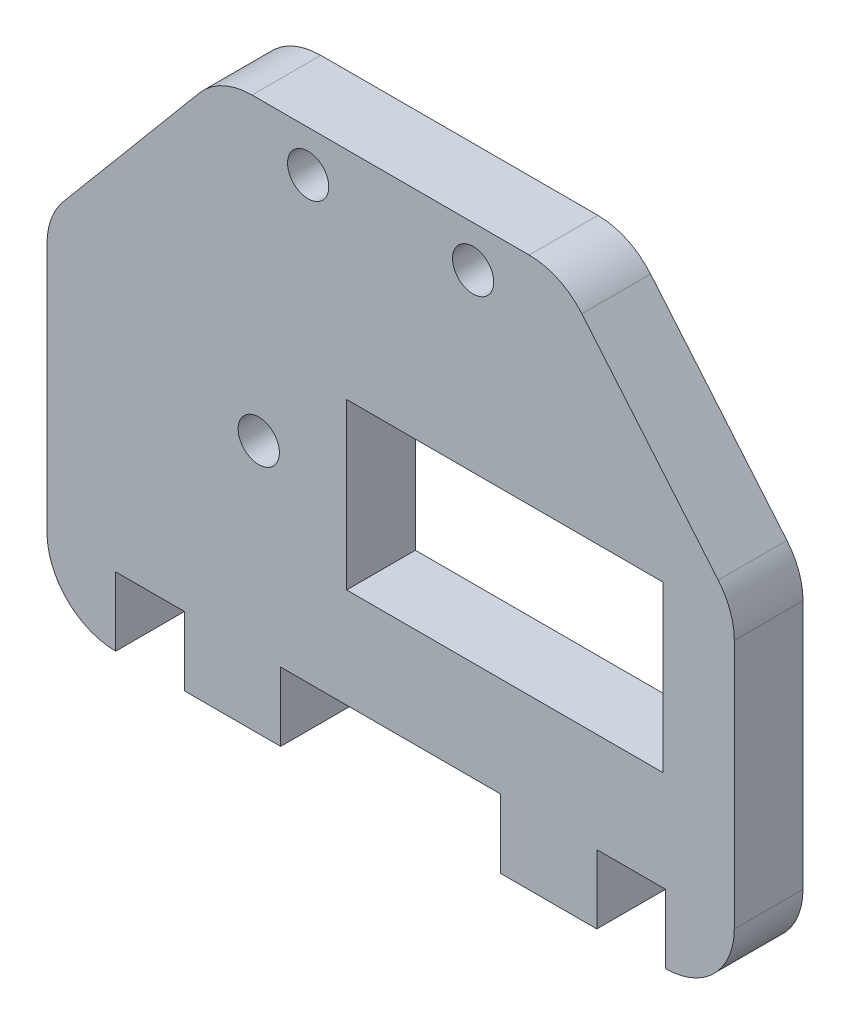
ISO-10303-21;
HEADER;
FILE_DESCRIPTION(('STEP AP214'),'2;1');
FILE_NAME('part.step','',(''),(''),'','','');
FILE_SCHEMA(('AUTOMOTIVE_DESIGN { 1 0 10303 214 1 1 1 1 }'));
ENDSEC;
DATA;
#1=APPLICATION_CONTEXT('core data for automotive mechanical design processes');
#2=APPLICATION_PROTOCOL_DEFINITION('international standard','automotive_design',2000,#1);
#3=PRODUCT_CONTEXT('',#1,'mechanical');
#4=PRODUCT('Part','Part','',(#3));
#5=PRODUCT_RELATED_PRODUCT_CATEGORY('part','',(#4));
#6=PRODUCT_DEFINITION_FORMATION('','',#4);
#7=PRODUCT_DEFINITION_CONTEXT('part definition',#1,'design');
#8=PRODUCT_DEFINITION('design','',#6,#7);
#9=PRODUCT_DEFINITION_SHAPE('','',#8);
#10=(LENGTH_UNIT() NAMED_UNIT(*) SI_UNIT(.MILLI.,.METRE.));
#11=(NAMED_UNIT(*) PLANE_ANGLE_UNIT() SI_UNIT($,.RADIAN.));
#12=(NAMED_UNIT(*) SI_UNIT($,.STERADIAN.) SOLID_ANGLE_UNIT());
#13=UNCERTAINTY_MEASURE_WITH_UNIT(LENGTH_MEASURE(1.E-05),#10,'distance_accuracy_value','');
#14=(GEOMETRIC_REPRESENTATION_CONTEXT(3) GLOBAL_UNCERTAINTY_ASSIGNED_CONTEXT((#13)) GLOBAL_UNIT_ASSIGNED_CONTEXT((#10,
#11,#12)) REPRESENTATION_CONTEXT('',''));
#15=CARTESIAN_POINT('',(0.,0.,0.));
#16=DIRECTION('',(0.,0.,1.));
#17=DIRECTION('',(1.,0.,0.));
#18=AXIS2_PLACEMENT_3D('',#15,#16,#17);
#19=CARTESIAN_POINT('',(-16.7689402270279,-9.81262327416174,5.));
#20=DIRECTION('',(0.,0.,1.));
#21=DIRECTION('',(1.,0.,0.));
#22=AXIS2_PLACEMENT_3D('',#19,#20,#21);
#23=CYLINDRICAL_SURFACE('',#22,5.);
#24=DIRECTION('',(0.,0.,1.));
#25=VECTOR('',#24,1.);
#26=CARTESIAN_POINT('',(-21.7689402270279,-9.81262327416174,5.));
#27=LINE('',#26,#25);
#28=CARTESIAN_POINT('',(-21.7689402270279,-9.81262327416174,0.));
#29=VERTEX_POINT('',#28);
#30=CARTESIAN_POINT('',(-21.7689402270279,-9.81262327416174,5.));
#31=VERTEX_POINT('',#30);
#32=EDGE_CURVE('E404',#29,#31,#27,.T.);
#33=ORIENTED_EDGE('',*,*,#32,.F.);
#34=CARTESIAN_POINT('',(-16.7689402270279,-9.81262327416174,0.));
#35=DIRECTION('',(0.,0.,-1.));
#36=DIRECTION('',(-1.,0.,0.));
#37=AXIS2_PLACEMENT_3D('',#34,#35,#36);
#38=CIRCLE('',#37,5.);
#39=CARTESIAN_POINT('',(-16.7689402270279,-14.8126232741617,0.));
#40=VERTEX_POINT('',#39);
#41=EDGE_CURVE('E39',#40,#29,#38,.T.);
#42=ORIENTED_EDGE('',*,*,#41,.F.);
#43=DIRECTION('',(0.,0.,-1.));
#44=VECTOR('',#43,1.);
#45=CARTESIAN_POINT('',(-16.7689402270279,-14.8126232741617,5.));
#46=LINE('',#45,#44);
#47=CARTESIAN_POINT('',(-16.7689402270279,-14.8126232741617,5.));
#48=VERTEX_POINT('',#47);
#49=EDGE_CURVE('E352',#48,#40,#46,.T.);
#50=ORIENTED_EDGE('',*,*,#49,.F.);
#51=CARTESIAN_POINT('',(-16.7689402270279,-9.81262327416174,5.));
#52=DIRECTION('',(0.,0.,-1.));
#53=DIRECTION('',(-1.,0.,0.));
#54=AXIS2_PLACEMENT_3D('',#51,#52,#53);
#55=CIRCLE('',#54,5.);
#56=EDGE_CURVE('E11',#31,#48,#55,.F.);
#57=ORIENTED_EDGE('',*,*,#56,.F.);
#58=EDGE_LOOP('',(#33,#42,#50,#57));
#59=FACE_BOUND('',#58,.T.);
#60=ADVANCED_FACE('F32',(#59),#23,.T.);
#61=CARTESIAN_POINT('',(-16.7689402270279,8.36752555450727,5.));
#62=DIRECTION('',(0.,0.,1.));
#63=DIRECTION('',(1.,0.,0.));
#64=AXIS2_PLACEMENT_3D('',#61,#62,#63);
#65=CYLINDRICAL_SURFACE('',#64,5.);
#66=DIRECTION('',(0.,0.,1.));
#67=VECTOR('',#66,1.);
#68=CARTESIAN_POINT('',(-20.5991624426228,11.5814636029399,5.));
#69=LINE('',#68,#67);
#70=CARTESIAN_POINT('',(-20.5991624426228,11.5814636029399,0.));
#71=VERTEX_POINT('',#70);
#72=CARTESIAN_POINT('',(-20.5991624426228,11.5814636029399,5.));
#73=VERTEX_POINT('',#72);
#74=EDGE_CURVE('E394',#71,#73,#69,.T.);
#75=ORIENTED_EDGE('',*,*,#74,.F.);
#76=CARTESIAN_POINT('',(-16.7689402270279,8.36752555450727,0.));
#77=DIRECTION('',(0.,0.,-1.));
#78=DIRECTION('',(-1.,0.,0.));
#79=AXIS2_PLACEMENT_3D('',#76,#77,#78);
#80=CIRCLE('',#79,5.);
#81=CARTESIAN_POINT('',(-21.7689402270279,8.36752555450726,0.));
#82=VERTEX_POINT('',#81);
#83=EDGE_CURVE('E400',#82,#71,#80,.T.);
#84=ORIENTED_EDGE('',*,*,#83,.F.);
#85=DIRECTION('',(0.,0.,1.));
#86=VECTOR('',#85,1.);
#87=CARTESIAN_POINT('',(-21.7689402270279,8.36752555450727,5.));
#88=LINE('',#87,#86);
#89=CARTESIAN_POINT('',(-21.7689402270279,8.36752555450726,5.));
#90=VERTEX_POINT('',#89);
#91=EDGE_CURVE('E397',#90,#82,#88,.F.);
#92=ORIENTED_EDGE('',*,*,#91,.F.);
#93=CARTESIAN_POINT('',(-16.7689402270279,8.36752555450727,5.));
#94=DIRECTION('',(0.,0.,-1.));
#95=DIRECTION('',(-1.,0.,0.));
#96=AXIS2_PLACEMENT_3D('',#93,#94,#95);
#97=CIRCLE('',#96,5.);
#98=EDGE_CURVE('E402',#73,#90,#97,.F.);
#99=ORIENTED_EDGE('',*,*,#98,.F.);
#100=EDGE_LOOP('',(#75,#84,#92,#99));
#101=FACE_BOUND('',#100,.T.);
#102=ADVANCED_FACE('F413',(#101),#65,.T.);
#103=CARTESIAN_POINT('',(-6.85090746859384,20.1873767258383,5.));
#104=DIRECTION('',(0.,0.,1.));
#105=DIRECTION('',(1.,0.,0.));
#106=AXIS2_PLACEMENT_3D('',#103,#104,#105);
#107=CYLINDRICAL_SURFACE('',#106,5.);
#108=DIRECTION('',(0.,0.,1.));
#109=VECTOR('',#108,1.);
#110=CARTESIAN_POINT('',(-6.85090746859384,25.1873767258383,5.));
#111=LINE('',#110,#109);
#112=CARTESIAN_POINT('',(-6.85090746859384,25.1873767258383,0.));
#113=VERTEX_POINT('',#112);
#114=CARTESIAN_POINT('',(-6.85090746859384,25.1873767258383,5.));
#115=VERTEX_POINT('',#114);
#116=EDGE_CURVE('E384',#113,#115,#111,.T.);
#117=ORIENTED_EDGE('',*,*,#116,.F.);
#118=CARTESIAN_POINT('',(-6.85090746859384,20.1873767258383,0.));
#119=DIRECTION('',(0.,0.,-1.));
#120=DIRECTION('',(-1.,0.,0.));
#121=AXIS2_PLACEMENT_3D('',#118,#119,#120);
#122=CIRCLE('',#121,5.);
#123=CARTESIAN_POINT('',(-10.6811296841887,23.4013147742709,0.));
#124=VERTEX_POINT('',#123);
#125=EDGE_CURVE('E390',#124,#113,#122,.T.);
#126=ORIENTED_EDGE('',*,*,#125,.F.);
#127=DIRECTION('',(0.,0.,1.));
#128=VECTOR('',#127,1.);
#129=CARTESIAN_POINT('',(-10.6811296841887,23.4013147742709,5.));
#130=LINE('',#129,#128);
#131=CARTESIAN_POINT('',(-10.6811296841887,23.4013147742709,5.));
#132=VERTEX_POINT('',#131);
#133=EDGE_CURVE('E387',#132,#124,#130,.F.);
#134=ORIENTED_EDGE('',*,*,#133,.F.);
#135=CARTESIAN_POINT('',(-6.85090746859384,20.1873767258383,5.));
#136=DIRECTION('',(0.,0.,-1.));
#137=DIRECTION('',(-1.,0.,0.));
#138=AXIS2_PLACEMENT_3D('',#135,#136,#137);
#139=CIRCLE('',#138,5.);
#140=EDGE_CURVE('E392',#115,#132,#139,.F.);
#141=ORIENTED_EDGE('',*,*,#140,.F.);
#142=EDGE_LOOP('',(#117,#126,#134,#141));
#143=FACE_BOUND('',#142,.T.);
#144=ADVANCED_FACE('F422',(#143),#107,.T.);
#145=CARTESIAN_POINT('',(23.2310597729721,-9.81262327416174,5.));
#146=DIRECTION('',(0.,0.,-1.));
#147=DIRECTION('',(-1.,0.,0.));
#148=AXIS2_PLACEMENT_3D('',#145,#146,#147);
#149=CYLINDRICAL_SURFACE('',#148,5.);
#150=DIRECTION('',(0.,0.,-1.));
#151=VECTOR('',#150,1.);
#152=CARTESIAN_POINT('',(28.2310597729721,-9.81262327416174,5.));
#153=LINE('',#152,#151);
#154=CARTESIAN_POINT('',(28.2310597729721,-9.81262327416174,5.));
#155=VERTEX_POINT('',#154);
#156=CARTESIAN_POINT('',(28.2310597729721,-9.81262327416174,0.));
#157=VERTEX_POINT('',#156);
#158=EDGE_CURVE('E377',#155,#157,#153,.T.);
#159=ORIENTED_EDGE('',*,*,#158,.F.);
#160=CARTESIAN_POINT('',(23.2310597729721,-9.81262327416174,5.));
#161=DIRECTION('',(0.,0.,-1.));
#162=DIRECTION('',(-1.,0.,0.));
#163=AXIS2_PLACEMENT_3D('',#160,#161,#162);
#164=CIRCLE('',#163,5.);
#165=CARTESIAN_POINT('',(23.2310597729721,-14.8126232741617,5.));
#166=VERTEX_POINT('',#165);
#167=EDGE_CURVE('E380',#166,#155,#164,.F.);
#168=ORIENTED_EDGE('',*,*,#167,.F.);
#169=DIRECTION('',(0.,0.,-1.));
#170=VECTOR('',#169,1.);
#171=CARTESIAN_POINT('',(23.2310597729721,-14.8126232741617,5.));
#172=LINE('',#171,#170);
#173=CARTESIAN_POINT('',(23.2310597729721,-14.8126232741617,0.));
#174=VERTEX_POINT('',#173);
#175=EDGE_CURVE('E285',#166,#174,#172,.T.);
#176=ORIENTED_EDGE('',*,*,#175,.T.);
#177=CARTESIAN_POINT('',(23.2310597729721,-9.81262327416174,0.));
#178=DIRECTION('',(0.,0.,-1.));
#179=DIRECTION('',(-1.,0.,0.));
#180=AXIS2_PLACEMENT_3D('',#177,#178,#179);
#181=CIRCLE('',#180,5.);
#182=EDGE_CURVE('E382',#157,#174,#181,.T.);
#183=ORIENTED_EDGE('',*,*,#182,.F.);
#184=EDGE_LOOP('',(#159,#168,#176,#183));
#185=FACE_BOUND('',#184,.T.);
#186=ADVANCED_FACE('F447',(#185),#149,.T.);
#187=CARTESIAN_POINT('',(23.2310597729721,8.36752555450727,5.));
#188=DIRECTION('',(0.,0.,-1.));
#189=DIRECTION('',(-1.,0.,0.));
#190=AXIS2_PLACEMENT_3D('',#187,#188,#189);
#191=CYLINDRICAL_SURFACE('',#190,5.);
#192=DIRECTION('',(0.,0.,-1.));
#193=VECTOR('',#192,1.);
#194=CARTESIAN_POINT('',(27.061281988567,11.5814636029399,5.));
#195=LINE('',#194,#193);
#196=CARTESIAN_POINT('',(27.061281988567,11.5814636029399,5.));
#197=VERTEX_POINT('',#196);
#198=CARTESIAN_POINT('',(27.061281988567,11.5814636029399,0.));
#199=VERTEX_POINT('',#198);
#200=EDGE_CURVE('E366',#197,#199,#195,.T.);
#201=ORIENTED_EDGE('',*,*,#200,.F.);
#202=CARTESIAN_POINT('',(23.2310597729721,8.36752555450727,5.));
#203=DIRECTION('',(0.,0.,-1.));
#204=DIRECTION('',(-1.,0.,0.));
#205=AXIS2_PLACEMENT_3D('',#202,#203,#204);
#206=CIRCLE('',#205,5.);
#207=CARTESIAN_POINT('',(28.2310597729721,8.36752555450727,5.));
#208=VERTEX_POINT('',#207);
#209=EDGE_CURVE('E372',#208,#197,#206,.F.);
#210=ORIENTED_EDGE('',*,*,#209,.F.);
#211=DIRECTION('',(0.,0.,-1.));
#212=VECTOR('',#211,1.);
#213=CARTESIAN_POINT('',(28.2310597729721,8.36752555450727,5.));
#214=LINE('',#213,#212);
#215=CARTESIAN_POINT('',(28.2310597729721,8.36752555450727,0.));
#216=VERTEX_POINT('',#215);
#217=EDGE_CURVE('E369',#216,#208,#214,.F.);
#218=ORIENTED_EDGE('',*,*,#217,.F.);
#219=CARTESIAN_POINT('',(23.2310597729721,8.36752555450727,0.));
#220=DIRECTION('',(0.,0.,-1.));
#221=DIRECTION('',(-1.,0.,0.));
#222=AXIS2_PLACEMENT_3D('',#219,#220,#221);
#223=CIRCLE('',#222,5.);
#224=EDGE_CURVE('E374',#199,#216,#223,.T.);
#225=ORIENTED_EDGE('',*,*,#224,.F.);
#226=EDGE_LOOP('',(#201,#210,#218,#225));
#227=FACE_BOUND('',#226,.T.);
#228=ADVANCED_FACE('F441',(#227),#191,.T.);
#229=CARTESIAN_POINT('',(13.313027014538,20.1873767258383,5.));
#230=DIRECTION('',(0.,0.,-1.));
#231=DIRECTION('',(-1.,0.,0.));
#232=AXIS2_PLACEMENT_3D('',#229,#230,#231);
#233=CYLINDRICAL_SURFACE('',#232,5.);
#234=DIRECTION('',(0.,0.,-1.));
#235=VECTOR('',#234,1.);
#236=CARTESIAN_POINT('',(13.313027014538,25.1873767258383,5.));
#237=LINE('',#236,#235);
#238=CARTESIAN_POINT('',(13.313027014538,25.1873767258383,5.));
#239=VERTEX_POINT('',#238);
#240=CARTESIAN_POINT('',(13.313027014538,25.1873767258383,0.));
#241=VERTEX_POINT('',#240);
#242=EDGE_CURVE('E355',#239,#241,#237,.T.);
#243=ORIENTED_EDGE('',*,*,#242,.F.);
#244=CARTESIAN_POINT('',(13.313027014538,20.1873767258383,5.));
#245=DIRECTION('',(0.,0.,-1.));
#246=DIRECTION('',(-1.,0.,0.));
#247=AXIS2_PLACEMENT_3D('',#244,#245,#246);
#248=CIRCLE('',#247,5.);
#249=CARTESIAN_POINT('',(17.1432492301329,23.401314774271,5.));
#250=VERTEX_POINT('',#249);
#251=EDGE_CURVE('E361',#250,#239,#248,.F.);
#252=ORIENTED_EDGE('',*,*,#251,.F.);
#253=DIRECTION('',(0.,0.,-1.));
#254=VECTOR('',#253,1.);
#255=CARTESIAN_POINT('',(17.1432492301329,23.4013147742709,5.));
#256=LINE('',#255,#254);
#257=CARTESIAN_POINT('',(17.1432492301329,23.401314774271,0.));
#258=VERTEX_POINT('',#257);
#259=EDGE_CURVE('E358',#258,#250,#256,.F.);
#260=ORIENTED_EDGE('',*,*,#259,.F.);
#261=CARTESIAN_POINT('',(13.313027014538,20.1873767258383,0.));
#262=DIRECTION('',(0.,0.,-1.));
#263=DIRECTION('',(-1.,0.,0.));
#264=AXIS2_PLACEMENT_3D('',#261,#262,#263);
#265=CIRCLE('',#264,5.);
#266=EDGE_CURVE('E363',#241,#258,#265,.T.);
#267=ORIENTED_EDGE('',*,*,#266,.F.);
#268=EDGE_LOOP('',(#243,#252,#260,#267));
#269=FACE_BOUND('',#268,.T.);
#270=ADVANCED_FACE('F432',(#269),#233,.T.);
#271=CARTESIAN_POINT('',(0.,0.,5.));
#272=DIRECTION('',(0.,0.,-1.));
#273=DIRECTION('',(-1.,0.,0.));
#274=AXIS2_PLACEMENT_3D('',#271,#272,#273);
#275=PLANE('',#274);
#276=DIRECTION('',(0.,-1.,0.));
#277=VECTOR('',#276,1.);
#278=CARTESIAN_POINT('',(-21.7689402270279,10.1873767258383,5.));
#279=LINE('',#278,#277);
#280=EDGE_CURVE('E259',#90,#31,#279,.T.);
#281=ORIENTED_EDGE('',*,*,#280,.T.);
#282=ORIENTED_EDGE('',*,*,#56,.T.);
#283=DIRECTION('',(0.,1.,0.));
#284=VECTOR('',#283,1.);
#285=CARTESIAN_POINT('',(-16.7689402270279,-14.8126232741617,5.));
#286=LINE('',#285,#284);
#287=CARTESIAN_POINT('',(-16.7689402270279,-9.81262327416174,5.));
#288=VERTEX_POINT('',#287);
#289=EDGE_CURVE('E262',#48,#288,#286,.T.);
#290=ORIENTED_EDGE('',*,*,#289,.T.);
#291=DIRECTION('',(1.,0.,0.));
#292=VECTOR('',#291,1.);
#293=CARTESIAN_POINT('',(-16.7689402270279,-9.81262327416174,5.));
#294=LINE('',#293,#292);
#295=CARTESIAN_POINT('',(-11.768940226988,-9.81262327416174,5.));
#296=VERTEX_POINT('',#295);
#297=EDGE_CURVE('E264',#288,#296,#294,.T.);
#298=ORIENTED_EDGE('',*,*,#297,.T.);
#299=DIRECTION('',(0.,-1.,0.));
#300=VECTOR('',#299,1.);
#301=CARTESIAN_POINT('',(-11.768940226988,-14.8126232741617,5.));
#302=LINE('',#301,#300);
#303=CARTESIAN_POINT('',(-11.768940226988,-14.8126232741617,5.));
#304=VERTEX_POINT('',#303);
#305=EDGE_CURVE('E266',#296,#304,#302,.T.);
#306=ORIENTED_EDGE('',*,*,#305,.T.);
#307=DIRECTION('',(1.,0.,0.));
#308=VECTOR('',#307,1.);
#309=CARTESIAN_POINT('',(-11.768940226988,-14.8126232741617,5.));
#310=LINE('',#309,#308);
#311=CARTESIAN_POINT('',(-4.76894022698801,-14.8126232741617,5.));
#312=VERTEX_POINT('',#311);
#313=EDGE_CURVE('E268',#304,#312,#310,.T.);
#314=ORIENTED_EDGE('',*,*,#313,.T.);
#315=DIRECTION('',(0.,1.,0.));
#316=VECTOR('',#315,1.);
#317=CARTESIAN_POINT('',(-4.76894022698801,-14.8126232741617,5.));
#318=LINE('',#317,#316);
#319=CARTESIAN_POINT('',(-4.76894022698801,-9.81262327416174,5.));
#320=VERTEX_POINT('',#319);
#321=EDGE_CURVE('E270',#312,#320,#318,.T.);
#322=ORIENTED_EDGE('',*,*,#321,.T.);
#323=DIRECTION('',(1.,0.,0.));
#324=VECTOR('',#323,1.);
#325=CARTESIAN_POINT('',(-4.76894022698801,-9.81262327416174,5.));
#326=LINE('',#325,#324);
#327=CARTESIAN_POINT('',(11.231059773012,-9.81262327416174,5.));
#328=VERTEX_POINT('',#327);
#329=EDGE_CURVE('E272',#320,#328,#326,.T.);
#330=ORIENTED_EDGE('',*,*,#329,.T.);
#331=DIRECTION('',(0.,-1.,0.));
#332=VECTOR('',#331,1.);
#333=CARTESIAN_POINT('',(11.231059773012,-14.8126232741617,5.));
#334=LINE('',#333,#332);
#335=CARTESIAN_POINT('',(11.231059773012,-14.8126232741617,5.));
#336=VERTEX_POINT('',#335);
#337=EDGE_CURVE('E274',#328,#336,#334,.T.);
#338=ORIENTED_EDGE('',*,*,#337,.T.);
#339=DIRECTION('',(1.,0.,0.));
#340=VECTOR('',#339,1.);
#341=CARTESIAN_POINT('',(18.231059773012,-14.8126232741617,5.));
#342=LINE('',#341,#340);
#343=CARTESIAN_POINT('',(18.231059773012,-14.8126232741617,5.));
#344=VERTEX_POINT('',#343);
#345=EDGE_CURVE('E276',#336,#344,#342,.T.);
#346=ORIENTED_EDGE('',*,*,#345,.T.);
#347=DIRECTION('',(0.,1.,0.));
#348=VECTOR('',#347,1.);
#349=CARTESIAN_POINT('',(18.231059773012,-14.8126232741617,5.));
#350=LINE('',#349,#348);
#351=CARTESIAN_POINT('',(18.231059773012,-9.81262327416174,5.));
#352=VERTEX_POINT('',#351);
#353=EDGE_CURVE('E278',#344,#352,#350,.T.);
#354=ORIENTED_EDGE('',*,*,#353,.T.);
#355=DIRECTION('',(1.,0.,0.));
#356=VECTOR('',#355,1.);
#357=CARTESIAN_POINT('',(18.231059773012,-9.81262327416174,5.));
#358=LINE('',#357,#356);
#359=CARTESIAN_POINT('',(23.2310597729721,-9.81262327416174,5.));
#360=VERTEX_POINT('',#359);
#361=EDGE_CURVE('E280',#352,#360,#358,.T.);
#362=ORIENTED_EDGE('',*,*,#361,.T.);
#363=DIRECTION('',(0.,-1.,0.));
#364=VECTOR('',#363,1.);
#365=CARTESIAN_POINT('',(23.2310597729721,-14.8126232741617,5.));
#366=LINE('',#365,#364);
#367=EDGE_CURVE('E282',#360,#166,#366,.T.);
#368=ORIENTED_EDGE('',*,*,#367,.T.);
#369=ORIENTED_EDGE('',*,*,#167,.T.);
#370=DIRECTION('',(0.,1.,0.));
#371=VECTOR('',#370,1.);
#372=CARTESIAN_POINT('',(28.2310597729721,10.1873767258383,5.));
#373=LINE('',#372,#371);
#374=EDGE_CURVE('E248',#155,#208,#373,.T.);
#375=ORIENTED_EDGE('',*,*,#374,.T.);
#376=ORIENTED_EDGE('',*,*,#209,.T.);
#377=DIRECTION('',(-0.642787609686535,0.766044443118982,0.));
#378=VECTOR('',#377,1.);
#379=CARTESIAN_POINT('',(28.2310597729721,10.1873767258383,5.));
#380=LINE('',#379,#378);
#381=EDGE_CURVE('E250',#197,#250,#380,.T.);
#382=ORIENTED_EDGE('',*,*,#381,.T.);
#383=ORIENTED_EDGE('',*,*,#251,.T.);
#384=DIRECTION('',(-1.,0.,0.));
#385=VECTOR('',#384,1.);
#386=CARTESIAN_POINT('',(-9.18244575936885,25.1873767258383,5.));
#387=LINE('',#386,#385);
#388=EDGE_CURVE('E253',#239,#115,#387,.T.);
#389=ORIENTED_EDGE('',*,*,#388,.T.);
#390=ORIENTED_EDGE('',*,*,#140,.T.);
#391=DIRECTION('',(-0.642787609686535,-0.766044443118982,0.));
#392=VECTOR('',#391,1.);
#393=CARTESIAN_POINT('',(-21.7689402270279,10.1873767258383,5.));
#394=LINE('',#393,#392);
#395=EDGE_CURVE('E256',#132,#73,#394,.T.);
#396=ORIENTED_EDGE('',*,*,#395,.T.);
#397=ORIENTED_EDGE('',*,*,#98,.T.);
#398=EDGE_LOOP('',(#281,#282,#290,#298,#306,#314,#322,#330,#338,#346,#354,#362,#368,#369,#375,
#376,#382,#383,#389,#390,#396,#397));
#399=FACE_BOUND('',#398,.T.);
#400=DIRECTION('',(0.,-1.,0.));
#401=VECTOR('',#400,1.);
#402=CARTESIAN_POINT('',(0.0310597729721029,9.44592971468198,5.));
#403=LINE('',#402,#401);
#404=CARTESIAN_POINT('',(0.0310597729721029,9.44592971468198,5.));
#405=VERTEX_POINT('',#404);
#406=CARTESIAN_POINT('',(0.0310597729721029,-2.55407028531802,5.));
#407=VERTEX_POINT('',#406);
#408=EDGE_CURVE('E203',#405,#407,#403,.T.);
#409=ORIENTED_EDGE('',*,*,#408,.F.);
#410=DIRECTION('',(-1.,0.,0.));
#411=VECTOR('',#410,1.);
#412=CARTESIAN_POINT('',(0.0310597729721029,9.44592971468198,5.));
#413=LINE('',#412,#411);
#414=CARTESIAN_POINT('',(23.0310597729721,9.44592971468198,5.));
#415=VERTEX_POINT('',#414);
#416=EDGE_CURVE('E230',#415,#405,#413,.T.);
#417=ORIENTED_EDGE('',*,*,#416,.F.);
#418=DIRECTION('',(0.,1.,0.));
#419=VECTOR('',#418,1.);
#420=CARTESIAN_POINT('',(23.0310597729721,9.44592971468198,5.));
#421=LINE('',#420,#419);
#422=CARTESIAN_POINT('',(23.0310597729721,-2.55407028531802,5.));
#423=VERTEX_POINT('',#422);
#424=EDGE_CURVE('E228',#423,#415,#421,.T.);
#425=ORIENTED_EDGE('',*,*,#424,.F.);
#426=DIRECTION('',(1.,0.,0.));
#427=VECTOR('',#426,1.);
#428=CARTESIAN_POINT('',(0.0310597729721029,-2.55407028531802,5.));
#429=LINE('',#428,#427);
#430=EDGE_CURVE('E213',#407,#423,#429,.T.);
#431=ORIENTED_EDGE('',*,*,#430,.F.);
#432=EDGE_LOOP('',(#409,#417,#425,#431));
#433=FACE_BOUND('',#432,.T.);
#434=CARTESIAN_POINT('',(-2.76894022702791,22.1873767258383,5.));
#435=DIRECTION('',(0.,0.,1.));
#436=DIRECTION('',(1.,0.,0.));
#437=AXIS2_PLACEMENT_3D('',#434,#435,#436);
#438=CIRCLE('',#437,1.5);
#439=CARTESIAN_POINT('',(-1.2689402270279,22.1873767258383,5.));
#440=VERTEX_POINT('',#439);
#441=EDGE_CURVE('E237',#440,#440,#438,.T.);
#442=ORIENTED_EDGE('',*,*,#441,.F.);
#443=EDGE_LOOP('',(#442));
#444=FACE_BOUND('',#443,.T.);
#445=CARTESIAN_POINT('',(9.23105977297209,22.1873767258383,5.));
#446=DIRECTION('',(0.,0.,1.));
#447=DIRECTION('',(1.,0.,0.));
#448=AXIS2_PLACEMENT_3D('',#445,#446,#447);
#449=CIRCLE('',#448,1.5);
#450=CARTESIAN_POINT('',(10.7310597729721,22.1873767258383,5.));
#451=VERTEX_POINT('',#450);
#452=EDGE_CURVE('E591',#451,#451,#449,.T.);
#453=ORIENTED_EDGE('',*,*,#452,.F.);
#454=EDGE_LOOP('',(#453));
#455=FACE_BOUND('',#454,.T.);
#456=CARTESIAN_POINT('',(-6.36189300420927,3.6459297145142,5.));
#457=DIRECTION('',(0.,0.,1.));
#458=DIRECTION('',(1.,0.,0.));
#459=AXIS2_PLACEMENT_3D('',#456,#457,#458);
#460=CIRCLE('',#459,1.5);
#461=CARTESIAN_POINT('',(-4.86189300420927,3.6459297145142,5.));
#462=VERTEX_POINT('',#461);
#463=EDGE_CURVE('E582',#462,#462,#460,.T.);
#464=ORIENTED_EDGE('',*,*,#463,.F.);
#465=EDGE_LOOP('',(#464));
#466=FACE_BOUND('',#465,.T.);
#467=ADVANCED_FACE('F225',(#399,#433,#444,#455,#466),#275,.F.);
#468=CARTESIAN_POINT('',(0.,0.,0.));
#469=DIRECTION('',(0.,0.,-1.));
#470=DIRECTION('',(-1.,0.,0.));
#471=AXIS2_PLACEMENT_3D('',#468,#469,#470);
#472=PLANE('',#471);
#473=CARTESIAN_POINT('',(9.23105977297209,22.1873767258383,0.));
#474=DIRECTION('',(0.,0.,1.));
#475=DIRECTION('',(1.,0.,0.));
#476=AXIS2_PLACEMENT_3D('',#473,#474,#475);
#477=CIRCLE('',#476,1.5);
#478=CARTESIAN_POINT('',(10.7310597729721,22.1873767258383,0.));
#479=VERTEX_POINT('',#478);
#480=EDGE_CURVE('E588',#479,#479,#477,.T.);
#481=ORIENTED_EDGE('',*,*,#480,.T.);
#482=EDGE_LOOP('',(#481));
#483=FACE_BOUND('',#482,.T.);
#484=DIRECTION('',(-1.,0.,0.));
#485=VECTOR('',#484,1.);
#486=CARTESIAN_POINT('',(0.0310597729721029,9.44592971468198,0.));
#487=LINE('',#486,#485);
#488=CARTESIAN_POINT('',(23.0310597729721,9.44592971468198,0.));
#489=VERTEX_POINT('',#488);
#490=CARTESIAN_POINT('',(0.0310597729721029,9.44592971468198,0.));
#491=VERTEX_POINT('',#490);
#492=EDGE_CURVE('E214',#489,#491,#487,.T.);
#493=ORIENTED_EDGE('',*,*,#492,.T.);
#494=DIRECTION('',(0.,-1.,0.));
#495=VECTOR('',#494,1.);
#496=CARTESIAN_POINT('',(0.0310597729721029,9.44592971468198,0.));
#497=LINE('',#496,#495);
#498=CARTESIAN_POINT('',(0.0310597729721029,-2.55407028531802,0.));
#499=VERTEX_POINT('',#498);
#500=EDGE_CURVE('E235',#491,#499,#497,.T.);
#501=ORIENTED_EDGE('',*,*,#500,.T.);
#502=DIRECTION('',(1.,0.,0.));
#503=VECTOR('',#502,1.);
#504=CARTESIAN_POINT('',(0.0310597729721029,-2.55407028531802,0.));
#505=LINE('',#504,#503);
#506=CARTESIAN_POINT('',(23.0310597729721,-2.55407028531802,0.));
#507=VERTEX_POINT('',#506);
#508=EDGE_CURVE('E220',#499,#507,#505,.T.);
#509=ORIENTED_EDGE('',*,*,#508,.T.);
#510=DIRECTION('',(0.,1.,0.));
#511=VECTOR('',#510,1.);
#512=CARTESIAN_POINT('',(23.0310597729721,9.44592971468198,0.));
#513=LINE('',#512,#511);
#514=EDGE_CURVE('E239',#507,#489,#513,.T.);
#515=ORIENTED_EDGE('',*,*,#514,.T.);
#516=EDGE_LOOP('',(#493,#501,#509,#515));
#517=FACE_BOUND('',#516,.T.);
#518=DIRECTION('',(0.,1.,0.));
#519=VECTOR('',#518,1.);
#520=CARTESIAN_POINT('',(-16.7689402270279,-14.8126232741617,0.));
#521=LINE('',#520,#519);
#522=CARTESIAN_POINT('',(-16.7689402270279,-9.81262327416174,0.));
#523=VERTEX_POINT('',#522);
#524=EDGE_CURVE('E298',#40,#523,#521,.T.);
#525=ORIENTED_EDGE('',*,*,#524,.F.);
#526=ORIENTED_EDGE('',*,*,#41,.T.);
#527=DIRECTION('',(0.,-1.,0.));
#528=VECTOR('',#527,1.);
#529=CARTESIAN_POINT('',(-21.7689402270279,10.1873767258383,0.));
#530=LINE('',#529,#528);
#531=EDGE_CURVE('E295',#82,#29,#530,.T.);
#532=ORIENTED_EDGE('',*,*,#531,.F.);
#533=ORIENTED_EDGE('',*,*,#83,.T.);
#534=DIRECTION('',(-0.642787609686535,-0.766044443118982,0.));
#535=VECTOR('',#534,1.);
#536=CARTESIAN_POINT('',(-21.7689402270279,10.1873767258383,0.));
#537=LINE('',#536,#535);
#538=EDGE_CURVE('E292',#124,#71,#537,.T.);
#539=ORIENTED_EDGE('',*,*,#538,.F.);
#540=ORIENTED_EDGE('',*,*,#125,.T.);
#541=DIRECTION('',(-1.,0.,0.));
#542=VECTOR('',#541,1.);
#543=CARTESIAN_POINT('',(-9.18244575936885,25.1873767258383,0.));
#544=LINE('',#543,#542);
#545=EDGE_CURVE('E289',#241,#113,#544,.T.);
#546=ORIENTED_EDGE('',*,*,#545,.F.);
#547=ORIENTED_EDGE('',*,*,#266,.T.);
#548=DIRECTION('',(-0.642787609686535,0.766044443118982,0.));
#549=VECTOR('',#548,1.);
#550=CARTESIAN_POINT('',(28.2310597729721,10.1873767258383,0.));
#551=LINE('',#550,#549);
#552=EDGE_CURVE('E287',#199,#258,#551,.T.);
#553=ORIENTED_EDGE('',*,*,#552,.F.);
#554=ORIENTED_EDGE('',*,*,#224,.T.);
#555=DIRECTION('',(0.,1.,0.));
#556=VECTOR('',#555,1.);
#557=CARTESIAN_POINT('',(28.2310597729721,10.1873767258383,0.));
#558=LINE('',#557,#556);
#559=EDGE_CURVE('E221',#157,#216,#558,.T.);
#560=ORIENTED_EDGE('',*,*,#559,.F.);
#561=ORIENTED_EDGE('',*,*,#182,.T.);
#562=DIRECTION('',(0.,-1.,0.));
#563=VECTOR('',#562,1.);
#564=CARTESIAN_POINT('',(23.2310597729721,-14.8126232741617,0.));
#565=LINE('',#564,#563);
#566=CARTESIAN_POINT('',(23.2310597729721,-9.81262327416174,0.));
#567=VERTEX_POINT('',#566);
#568=EDGE_CURVE('E251',#567,#174,#565,.T.);
#569=ORIENTED_EDGE('',*,*,#568,.F.);
#570=DIRECTION('',(1.,0.,0.));
#571=VECTOR('',#570,1.);
#572=CARTESIAN_POINT('',(18.231059773012,-9.81262327416174,0.));
#573=LINE('',#572,#571);
#574=CARTESIAN_POINT('',(18.231059773012,-9.81262327416174,0.));
#575=VERTEX_POINT('',#574);
#576=EDGE_CURVE('E316',#575,#567,#573,.T.);
#577=ORIENTED_EDGE('',*,*,#576,.F.);
#578=DIRECTION('',(0.,1.,0.));
#579=VECTOR('',#578,1.);
#580=CARTESIAN_POINT('',(18.231059773012,-14.8126232741617,0.));
#581=LINE('',#580,#579);
#582=CARTESIAN_POINT('',(18.231059773012,-14.8126232741617,0.));
#583=VERTEX_POINT('',#582);
#584=EDGE_CURVE('E314',#583,#575,#581,.T.);
#585=ORIENTED_EDGE('',*,*,#584,.F.);
#586=DIRECTION('',(1.,0.,0.));
#587=VECTOR('',#586,1.);
#588=CARTESIAN_POINT('',(18.231059773012,-14.8126232741617,0.));
#589=LINE('',#588,#587);
#590=CARTESIAN_POINT('',(11.231059773012,-14.8126232741617,0.));
#591=VERTEX_POINT('',#590);
#592=EDGE_CURVE('E312',#591,#583,#589,.T.);
#593=ORIENTED_EDGE('',*,*,#592,.F.);
#594=DIRECTION('',(0.,-1.,0.));
#595=VECTOR('',#594,1.);
#596=CARTESIAN_POINT('',(11.231059773012,-14.8126232741617,0.));
#597=LINE('',#596,#595);
#598=CARTESIAN_POINT('',(11.231059773012,-9.81262327416174,0.));
#599=VERTEX_POINT('',#598);
#600=EDGE_CURVE('E310',#599,#591,#597,.T.);
#601=ORIENTED_EDGE('',*,*,#600,.F.);
#602=DIRECTION('',(1.,0.,0.));
#603=VECTOR('',#602,1.);
#604=CARTESIAN_POINT('',(-4.76894022698801,-9.81262327416174,0.));
#605=LINE('',#604,#603);
#606=CARTESIAN_POINT('',(-4.76894022698801,-9.81262327416174,0.));
#607=VERTEX_POINT('',#606);
#608=EDGE_CURVE('E308',#607,#599,#605,.T.);
#609=ORIENTED_EDGE('',*,*,#608,.F.);
#610=DIRECTION('',(0.,1.,0.));
#611=VECTOR('',#610,1.);
#612=CARTESIAN_POINT('',(-4.76894022698801,-14.8126232741617,0.));
#613=LINE('',#612,#611);
#614=CARTESIAN_POINT('',(-4.76894022698801,-14.8126232741617,0.));
#615=VERTEX_POINT('',#614);
#616=EDGE_CURVE('E306',#615,#607,#613,.T.);
#617=ORIENTED_EDGE('',*,*,#616,.F.);
#618=DIRECTION('',(1.,0.,0.));
#619=VECTOR('',#618,1.);
#620=CARTESIAN_POINT('',(-11.768940226988,-14.8126232741617,0.));
#621=LINE('',#620,#619);
#622=CARTESIAN_POINT('',(-11.768940226988,-14.8126232741617,0.));
#623=VERTEX_POINT('',#622);
#624=EDGE_CURVE('E304',#623,#615,#621,.T.);
#625=ORIENTED_EDGE('',*,*,#624,.F.);
#626=DIRECTION('',(0.,-1.,0.));
#627=VECTOR('',#626,1.);
#628=CARTESIAN_POINT('',(-11.768940226988,-14.8126232741617,0.));
#629=LINE('',#628,#627);
#630=CARTESIAN_POINT('',(-11.768940226988,-9.81262327416174,0.));
#631=VERTEX_POINT('',#630);
#632=EDGE_CURVE('E302',#631,#623,#629,.T.);
#633=ORIENTED_EDGE('',*,*,#632,.F.);
#634=DIRECTION('',(1.,0.,0.));
#635=VECTOR('',#634,1.);
#636=CARTESIAN_POINT('',(-16.7689402270279,-9.81262327416174,0.));
#637=LINE('',#636,#635);
#638=EDGE_CURVE('E300',#523,#631,#637,.T.);
#639=ORIENTED_EDGE('',*,*,#638,.F.);
#640=EDGE_LOOP('',(#525,#526,#532,#533,#539,#540,#546,#547,#553,#554,#560,#561,#569,#577,#585,
#593,#601,#609,#617,#625,#633,#639));
#641=FACE_BOUND('',#640,.T.);
#642=CARTESIAN_POINT('',(-2.76894022702791,22.1873767258383,0.));
#643=DIRECTION('',(0.,0.,1.));
#644=DIRECTION('',(1.,0.,0.));
#645=AXIS2_PLACEMENT_3D('',#642,#643,#644);
#646=CIRCLE('',#645,1.5);
#647=CARTESIAN_POINT('',(-1.2689402270279,22.1873767258383,0.));
#648=VERTEX_POINT('',#647);
#649=EDGE_CURVE('E594',#648,#648,#646,.T.);
#650=ORIENTED_EDGE('',*,*,#649,.T.);
#651=EDGE_LOOP('',(#650));
#652=FACE_BOUND('',#651,.T.);
#653=CARTESIAN_POINT('',(-6.36189300420927,3.6459297145142,0.));
#654=DIRECTION('',(0.,0.,1.));
#655=DIRECTION('',(1.,0.,0.));
#656=AXIS2_PLACEMENT_3D('',#653,#654,#655);
#657=CIRCLE('',#656,1.5);
#658=CARTESIAN_POINT('',(-4.86189300420927,3.6459297145142,0.));
#659=VERTEX_POINT('',#658);
#660=EDGE_CURVE('E585',#659,#659,#657,.T.);
#661=ORIENTED_EDGE('',*,*,#660,.T.);
#662=EDGE_LOOP('',(#661));
#663=FACE_BOUND('',#662,.T.);
#664=ADVANCED_FACE('F414',(#483,#517,#641,#652,#663),#472,.T.);
#665=CARTESIAN_POINT('',(28.2310597729721,10.1873767258383,5.));
#666=DIRECTION('',(-1.,0.,0.));
#667=DIRECTION('',(0.,0.,1.));
#668=AXIS2_PLACEMENT_3D('',#665,#666,#667);
#669=PLANE('',#668);
#670=ORIENTED_EDGE('',*,*,#374,.F.);
#671=ORIENTED_EDGE('',*,*,#158,.T.);
#672=ORIENTED_EDGE('',*,*,#559,.T.);
#673=ORIENTED_EDGE('',*,*,#217,.T.);
#674=EDGE_LOOP('',(#670,#671,#672,#673));
#675=FACE_BOUND('',#674,.T.);
#676=ADVANCED_FACE('F444',(#675),#669,.F.);
#677=CARTESIAN_POINT('',(28.2310597729721,10.1873767258383,5.));
#678=DIRECTION('',(-0.766044443118982,-0.642787609686535,0.));
#679=DIRECTION('',(0.642787609686535,-0.766044443118982,0.));
#680=AXIS2_PLACEMENT_3D('',#677,#678,#679);
#681=PLANE('',#680);
#682=ORIENTED_EDGE('',*,*,#381,.F.);
#683=ORIENTED_EDGE('',*,*,#200,.T.);
#684=ORIENTED_EDGE('',*,*,#552,.T.);
#685=ORIENTED_EDGE('',*,*,#259,.T.);
#686=EDGE_LOOP('',(#682,#683,#684,#685));
#687=FACE_BOUND('',#686,.T.);
#688=ADVANCED_FACE('F435',(#687),#681,.F.);
#689=CARTESIAN_POINT('',(-9.18244575936885,25.1873767258383,5.));
#690=DIRECTION('',(0.,-1.,0.));
#691=DIRECTION('',(1.,0.,0.));
#692=AXIS2_PLACEMENT_3D('',#689,#690,#691);
#693=PLANE('',#692);
#694=ORIENTED_EDGE('',*,*,#545,.T.);
#695=ORIENTED_EDGE('',*,*,#116,.T.);
#696=ORIENTED_EDGE('',*,*,#388,.F.);
#697=ORIENTED_EDGE('',*,*,#242,.T.);
#698=EDGE_LOOP('',(#694,#695,#696,#697));
#699=FACE_BOUND('',#698,.T.);
#700=ADVANCED_FACE('F427',(#699),#693,.F.);
#701=CARTESIAN_POINT('',(-21.7689402270279,10.1873767258383,5.));
#702=DIRECTION('',(0.766044443118982,-0.642787609686535,0.));
#703=DIRECTION('',(0.642787609686535,0.766044443118982,0.));
#704=AXIS2_PLACEMENT_3D('',#701,#702,#703);
#705=PLANE('',#704);
#706=ORIENTED_EDGE('',*,*,#538,.T.);
#707=ORIENTED_EDGE('',*,*,#74,.T.);
#708=ORIENTED_EDGE('',*,*,#395,.F.);
#709=ORIENTED_EDGE('',*,*,#133,.T.);
#710=EDGE_LOOP('',(#706,#707,#708,#709));
#711=FACE_BOUND('',#710,.T.);
#712=ADVANCED_FACE('F418',(#711),#705,.F.);
#713=CARTESIAN_POINT('',(-21.7689402270279,10.1873767258383,5.));
#714=DIRECTION('',(1.,0.,0.));
#715=DIRECTION('',(0.,0.,-1.));
#716=AXIS2_PLACEMENT_3D('',#713,#714,#715);
#717=PLANE('',#716);
#718=ORIENTED_EDGE('',*,*,#531,.T.);
#719=ORIENTED_EDGE('',*,*,#32,.T.);
#720=ORIENTED_EDGE('',*,*,#280,.F.);
#721=ORIENTED_EDGE('',*,*,#91,.T.);
#722=EDGE_LOOP('',(#718,#719,#720,#721));
#723=FACE_BOUND('',#722,.T.);
#724=ADVANCED_FACE('F407',(#723),#717,.F.);
#725=CARTESIAN_POINT('',(-16.7689402270279,-14.8126232741617,5.));
#726=DIRECTION('',(-1.,0.,0.));
#727=DIRECTION('',(0.,0.,1.));
#728=AXIS2_PLACEMENT_3D('',#725,#726,#727);
#729=PLANE('',#728);
#730=ORIENTED_EDGE('',*,*,#524,.T.);
#731=DIRECTION('',(0.,0.,-1.));
#732=VECTOR('',#731,1.);
#733=CARTESIAN_POINT('',(-16.7689402270279,-9.81262327416174,5.));
#734=LINE('',#733,#732);
#735=EDGE_CURVE('E349',#288,#523,#734,.T.);
#736=ORIENTED_EDGE('',*,*,#735,.F.);
#737=ORIENTED_EDGE('',*,*,#289,.F.);
#738=ORIENTED_EDGE('',*,*,#49,.T.);
#739=EDGE_LOOP('',(#730,#736,#737,#738));
#740=FACE_BOUND('',#739,.T.);
#741=ADVANCED_FACE('F501',(#740),#729,.F.);
#742=CARTESIAN_POINT('',(-16.7689402270279,-9.81262327416174,5.));
#743=DIRECTION('',(0.,1.,0.));
#744=DIRECTION('',(0.,0.,1.));
#745=AXIS2_PLACEMENT_3D('',#742,#743,#744);
#746=PLANE('',#745);
#747=ORIENTED_EDGE('',*,*,#638,.T.);
#748=DIRECTION('',(0.,0.,-1.));
#749=VECTOR('',#748,1.);
#750=CARTESIAN_POINT('',(-11.768940226988,-9.81262327416174,5.));
#751=LINE('',#750,#749);
#752=EDGE_CURVE('E346',#296,#631,#751,.T.);
#753=ORIENTED_EDGE('',*,*,#752,.F.);
#754=ORIENTED_EDGE('',*,*,#297,.F.);
#755=ORIENTED_EDGE('',*,*,#735,.T.);
#756=EDGE_LOOP('',(#747,#753,#754,#755));
#757=FACE_BOUND('',#756,.T.);
#758=ADVANCED_FACE('F497',(#757),#746,.F.);
#759=CARTESIAN_POINT('',(-11.768940226988,-14.8126232741617,5.));
#760=DIRECTION('',(1.,0.,0.));
#761=DIRECTION('',(0.,0.,-1.));
#762=AXIS2_PLACEMENT_3D('',#759,#760,#761);
#763=PLANE('',#762);
#764=ORIENTED_EDGE('',*,*,#632,.T.);
#765=DIRECTION('',(0.,0.,-1.));
#766=VECTOR('',#765,1.);
#767=CARTESIAN_POINT('',(-11.768940226988,-14.8126232741617,5.));
#768=LINE('',#767,#766);
#769=EDGE_CURVE('E343',#304,#623,#768,.T.);
#770=ORIENTED_EDGE('',*,*,#769,.F.);
#771=ORIENTED_EDGE('',*,*,#305,.F.);
#772=ORIENTED_EDGE('',*,*,#752,.T.);
#773=EDGE_LOOP('',(#764,#770,#771,#772));
#774=FACE_BOUND('',#773,.T.);
#775=ADVANCED_FACE('F492',(#774),#763,.F.);
#776=CARTESIAN_POINT('',(-11.768940226988,-14.8126232741617,5.));
#777=DIRECTION('',(0.,1.,0.));
#778=DIRECTION('',(0.,0.,1.));
#779=AXIS2_PLACEMENT_3D('',#776,#777,#778);
#780=PLANE('',#779);
#781=ORIENTED_EDGE('',*,*,#624,.T.);
#782=DIRECTION('',(0.,0.,-1.));
#783=VECTOR('',#782,1.);
#784=CARTESIAN_POINT('',(-4.76894022698801,-14.8126232741617,5.));
#785=LINE('',#784,#783);
#786=EDGE_CURVE('E340',#312,#615,#785,.T.);
#787=ORIENTED_EDGE('',*,*,#786,.F.);
#788=ORIENTED_EDGE('',*,*,#313,.F.);
#789=ORIENTED_EDGE('',*,*,#769,.T.);
#790=EDGE_LOOP('',(#781,#787,#788,#789));
#791=FACE_BOUND('',#790,.T.);
#792=ADVANCED_FACE('F487',(#791),#780,.F.);
#793=CARTESIAN_POINT('',(-4.76894022698801,-14.8126232741617,5.));
#794=DIRECTION('',(-1.,0.,0.));
#795=DIRECTION('',(0.,0.,1.));
#796=AXIS2_PLACEMENT_3D('',#793,#794,#795);
#797=PLANE('',#796);
#798=ORIENTED_EDGE('',*,*,#616,.T.);
#799=DIRECTION('',(0.,0.,-1.));
#800=VECTOR('',#799,1.);
#801=CARTESIAN_POINT('',(-4.76894022698801,-9.81262327416174,5.));
#802=LINE('',#801,#800);
#803=EDGE_CURVE('E337',#320,#607,#802,.T.);
#804=ORIENTED_EDGE('',*,*,#803,.F.);
#805=ORIENTED_EDGE('',*,*,#321,.F.);
#806=ORIENTED_EDGE('',*,*,#786,.T.);
#807=EDGE_LOOP('',(#798,#804,#805,#806));
#808=FACE_BOUND('',#807,.T.);
#809=ADVANCED_FACE('F483',(#808),#797,.F.);
#810=CARTESIAN_POINT('',(-4.76894022698801,-9.81262327416174,5.));
#811=DIRECTION('',(0.,1.,0.));
#812=DIRECTION('',(0.,0.,1.));
#813=AXIS2_PLACEMENT_3D('',#810,#811,#812);
#814=PLANE('',#813);
#815=ORIENTED_EDGE('',*,*,#608,.T.);
#816=DIRECTION('',(0.,0.,-1.));
#817=VECTOR('',#816,1.);
#818=CARTESIAN_POINT('',(11.231059773012,-9.81262327416174,5.));
#819=LINE('',#818,#817);
#820=EDGE_CURVE('E334',#328,#599,#819,.T.);
#821=ORIENTED_EDGE('',*,*,#820,.F.);
#822=ORIENTED_EDGE('',*,*,#329,.F.);
#823=ORIENTED_EDGE('',*,*,#803,.T.);
#824=EDGE_LOOP('',(#815,#821,#822,#823));
#825=FACE_BOUND('',#824,.T.);
#826=ADVANCED_FACE('F478',(#825),#814,.F.);
#827=CARTESIAN_POINT('',(11.231059773012,-14.8126232741617,5.));
#828=DIRECTION('',(1.,0.,0.));
#829=DIRECTION('',(0.,0.,-1.));
#830=AXIS2_PLACEMENT_3D('',#827,#828,#829);
#831=PLANE('',#830);
#832=ORIENTED_EDGE('',*,*,#600,.T.);
#833=DIRECTION('',(0.,0.,-1.));
#834=VECTOR('',#833,1.);
#835=CARTESIAN_POINT('',(11.231059773012,-14.8126232741617,5.));
#836=LINE('',#835,#834);
#837=EDGE_CURVE('E331',#336,#591,#836,.T.);
#838=ORIENTED_EDGE('',*,*,#837,.F.);
#839=ORIENTED_EDGE('',*,*,#337,.F.);
#840=ORIENTED_EDGE('',*,*,#820,.T.);
#841=EDGE_LOOP('',(#832,#838,#839,#840));
#842=FACE_BOUND('',#841,.T.);
#843=ADVANCED_FACE('F472',(#842),#831,.F.);
#844=CARTESIAN_POINT('',(18.231059773012,-14.8126232741617,5.));
#845=DIRECTION('',(0.,1.,0.));
#846=DIRECTION('',(0.,0.,1.));
#847=AXIS2_PLACEMENT_3D('',#844,#845,#846);
#848=PLANE('',#847);
#849=ORIENTED_EDGE('',*,*,#592,.T.);
#850=DIRECTION('',(0.,0.,-1.));
#851=VECTOR('',#850,1.);
#852=CARTESIAN_POINT('',(18.231059773012,-14.8126232741617,5.));
#853=LINE('',#852,#851);
#854=EDGE_CURVE('E328',#344,#583,#853,.T.);
#855=ORIENTED_EDGE('',*,*,#854,.F.);
#856=ORIENTED_EDGE('',*,*,#345,.F.);
#857=ORIENTED_EDGE('',*,*,#837,.T.);
#858=EDGE_LOOP('',(#849,#855,#856,#857));
#859=FACE_BOUND('',#858,.T.);
#860=ADVANCED_FACE('F468',(#859),#848,.F.);
#861=CARTESIAN_POINT('',(18.231059773012,-14.8126232741617,5.));
#862=DIRECTION('',(-1.,0.,0.));
#863=DIRECTION('',(0.,0.,1.));
#864=AXIS2_PLACEMENT_3D('',#861,#862,#863);
#865=PLANE('',#864);
#866=ORIENTED_EDGE('',*,*,#584,.T.);
#867=DIRECTION('',(0.,0.,-1.));
#868=VECTOR('',#867,1.);
#869=CARTESIAN_POINT('',(18.231059773012,-9.81262327416174,5.));
#870=LINE('',#869,#868);
#871=EDGE_CURVE('E325',#352,#575,#870,.T.);
#872=ORIENTED_EDGE('',*,*,#871,.F.);
#873=ORIENTED_EDGE('',*,*,#353,.F.);
#874=ORIENTED_EDGE('',*,*,#854,.T.);
#875=EDGE_LOOP('',(#866,#872,#873,#874));
#876=FACE_BOUND('',#875,.T.);
#877=ADVANCED_FACE('F463',(#876),#865,.F.);
#878=CARTESIAN_POINT('',(18.231059773012,-9.81262327416174,5.));
#879=DIRECTION('',(0.,1.,0.));
#880=DIRECTION('',(0.,0.,1.));
#881=AXIS2_PLACEMENT_3D('',#878,#879,#880);
#882=PLANE('',#881);
#883=ORIENTED_EDGE('',*,*,#576,.T.);
#884=DIRECTION('',(0.,0.,-1.));
#885=VECTOR('',#884,1.);
#886=CARTESIAN_POINT('',(23.2310597729721,-9.81262327416174,5.));
#887=LINE('',#886,#885);
#888=EDGE_CURVE('E322',#360,#567,#887,.T.);
#889=ORIENTED_EDGE('',*,*,#888,.F.);
#890=ORIENTED_EDGE('',*,*,#361,.F.);
#891=ORIENTED_EDGE('',*,*,#871,.T.);
#892=EDGE_LOOP('',(#883,#889,#890,#891));
#893=FACE_BOUND('',#892,.T.);
#894=ADVANCED_FACE('F457',(#893),#882,.F.);
#895=CARTESIAN_POINT('',(23.2310597729721,-14.8126232741617,5.));
#896=DIRECTION('',(1.,0.,0.));
#897=DIRECTION('',(0.,0.,-1.));
#898=AXIS2_PLACEMENT_3D('',#895,#896,#897);
#899=PLANE('',#898);
#900=ORIENTED_EDGE('',*,*,#568,.T.);
#901=ORIENTED_EDGE('',*,*,#175,.F.);
#902=ORIENTED_EDGE('',*,*,#367,.F.);
#903=ORIENTED_EDGE('',*,*,#888,.T.);
#904=EDGE_LOOP('',(#900,#901,#902,#903));
#905=FACE_BOUND('',#904,.T.);
#906=ADVANCED_FACE('F452',(#905),#899,.F.);
#907=CARTESIAN_POINT('',(0.0310597729721029,9.44592971468198,5.));
#908=DIRECTION('',(1.,0.,0.));
#909=DIRECTION('',(0.,0.,-1.));
#910=AXIS2_PLACEMENT_3D('',#907,#908,#909);
#911=PLANE('',#910);
#912=ORIENTED_EDGE('',*,*,#500,.F.);
#913=DIRECTION('',(0.,0.,-1.));
#914=VECTOR('',#913,1.);
#915=CARTESIAN_POINT('',(0.0310597729721029,9.44592971468198,5.));
#916=LINE('',#915,#914);
#917=EDGE_CURVE('E209',#405,#491,#916,.T.);
#918=ORIENTED_EDGE('',*,*,#917,.F.);
#919=ORIENTED_EDGE('',*,*,#408,.T.);
#920=DIRECTION('',(0.,0.,-1.));
#921=VECTOR('',#920,1.);
#922=CARTESIAN_POINT('',(0.0310597729721029,-2.55407028531802,5.));
#923=LINE('',#922,#921);
#924=EDGE_CURVE('E206',#407,#499,#923,.T.);
#925=ORIENTED_EDGE('',*,*,#924,.T.);
#926=EDGE_LOOP('',(#912,#918,#919,#925));
#927=FACE_BOUND('',#926,.T.);
#928=ADVANCED_FACE('F205',(#927),#911,.T.);
#929=CARTESIAN_POINT('',(0.0310597729721029,-2.55407028531802,5.));
#930=DIRECTION('',(0.,1.,0.));
#931=DIRECTION('',(0.,0.,1.));
#932=AXIS2_PLACEMENT_3D('',#929,#930,#931);
#933=PLANE('',#932);
#934=ORIENTED_EDGE('',*,*,#508,.F.);
#935=ORIENTED_EDGE('',*,*,#924,.F.);
#936=ORIENTED_EDGE('',*,*,#430,.T.);
#937=DIRECTION('',(0.,0.,-1.));
#938=VECTOR('',#937,1.);
#939=CARTESIAN_POINT('',(23.0310597729721,-2.55407028531802,5.));
#940=LINE('',#939,#938);
#941=EDGE_CURVE('E222',#423,#507,#940,.T.);
#942=ORIENTED_EDGE('',*,*,#941,.T.);
#943=EDGE_LOOP('',(#934,#935,#936,#942));
#944=FACE_BOUND('',#943,.T.);
#945=ADVANCED_FACE('F217',(#944),#933,.T.);
#946=CARTESIAN_POINT('',(23.0310597729721,9.44592971468198,5.));
#947=DIRECTION('',(-1.,0.,0.));
#948=DIRECTION('',(0.,0.,1.));
#949=AXIS2_PLACEMENT_3D('',#946,#947,#948);
#950=PLANE('',#949);
#951=ORIENTED_EDGE('',*,*,#514,.F.);
#952=ORIENTED_EDGE('',*,*,#941,.F.);
#953=ORIENTED_EDGE('',*,*,#424,.T.);
#954=DIRECTION('',(0.,0.,-1.));
#955=VECTOR('',#954,1.);
#956=CARTESIAN_POINT('',(23.0310597729721,9.44592971468198,5.));
#957=LINE('',#956,#955);
#958=EDGE_CURVE('E245',#415,#489,#957,.T.);
#959=ORIENTED_EDGE('',*,*,#958,.T.);
#960=EDGE_LOOP('',(#951,#952,#953,#959));
#961=FACE_BOUND('',#960,.T.);
#962=ADVANCED_FACE('F558',(#961),#950,.T.);
#963=CARTESIAN_POINT('',(0.0310597729721029,9.44592971468198,5.));
#964=DIRECTION('',(0.,-1.,0.));
#965=DIRECTION('',(1.,0.,0.));
#966=AXIS2_PLACEMENT_3D('',#963,#964,#965);
#967=PLANE('',#966);
#968=ORIENTED_EDGE('',*,*,#492,.F.);
#969=ORIENTED_EDGE('',*,*,#958,.F.);
#970=ORIENTED_EDGE('',*,*,#416,.T.);
#971=ORIENTED_EDGE('',*,*,#917,.T.);
#972=EDGE_LOOP('',(#968,#969,#970,#971));
#973=FACE_BOUND('',#972,.T.);
#974=ADVANCED_FACE('F561',(#973),#967,.T.);
#975=CARTESIAN_POINT('',(-2.76894022702791,22.1873767258383,5.));
#976=DIRECTION('',(0.,0.,-1.));
#977=DIRECTION('',(-1.,0.,0.));
#978=AXIS2_PLACEMENT_3D('',#975,#976,#977);
#979=CYLINDRICAL_SURFACE('',#978,1.5);
#980=ORIENTED_EDGE('',*,*,#441,.T.);
#981=EDGE_LOOP('',(#980));
#982=FACE_BOUND('',#981,.T.);
#983=ORIENTED_EDGE('',*,*,#649,.F.);
#984=EDGE_LOOP('',(#983));
#985=FACE_BOUND('',#984,.T.);
#986=ADVANCED_FACE('F565',(#982,#985),#979,.F.);
#987=CARTESIAN_POINT('',(9.23105977297209,22.1873767258383,5.));
#988=DIRECTION('',(0.,0.,-1.));
#989=DIRECTION('',(-1.,0.,0.));
#990=AXIS2_PLACEMENT_3D('',#987,#988,#989);
#991=CYLINDRICAL_SURFACE('',#990,1.5);
#992=ORIENTED_EDGE('',*,*,#452,.T.);
#993=EDGE_LOOP('',(#992));
#994=FACE_BOUND('',#993,.T.);
#995=ORIENTED_EDGE('',*,*,#480,.F.);
#996=EDGE_LOOP('',(#995));
#997=FACE_BOUND('',#996,.T.);
#998=ADVANCED_FACE('F569',(#994,#997),#991,.F.);
#999=CARTESIAN_POINT('',(-6.36189300420927,3.6459297145142,5.));
#1000=DIRECTION('',(0.,0.,-1.));
#1001=DIRECTION('',(-1.,0.,0.));
#1002=AXIS2_PLACEMENT_3D('',#999,#1000,#1001);
#1003=CYLINDRICAL_SURFACE('',#1002,1.5);
#1004=ORIENTED_EDGE('',*,*,#463,.T.);
#1005=EDGE_LOOP('',(#1004));
#1006=FACE_BOUND('',#1005,.T.);
#1007=ORIENTED_EDGE('',*,*,#660,.F.);
#1008=EDGE_LOOP('',(#1007));
#1009=FACE_BOUND('',#1008,.T.);
#1010=ADVANCED_FACE('F573',(#1006,#1009),#1003,.F.);
#1011=CLOSED_SHELL('',(#60,#102,#144,#186,#228,#270,#467,#664,#676,#688,#700,#712,#724,#741,
#758,#775,#792,#809,#826,#843,#860,#877,#894,#906,#928,#945,#962,#974,#986,#998,#1010));
#1012=MANIFOLD_SOLID_BREP('B2',#1011);
#1013=ADVANCED_BREP_SHAPE_REPRESENTATION('',(#18,#1012),#14);
#1014=SHAPE_DEFINITION_REPRESENTATION(#9,#1013);
ENDSEC;
END-ISO-10303-21;
